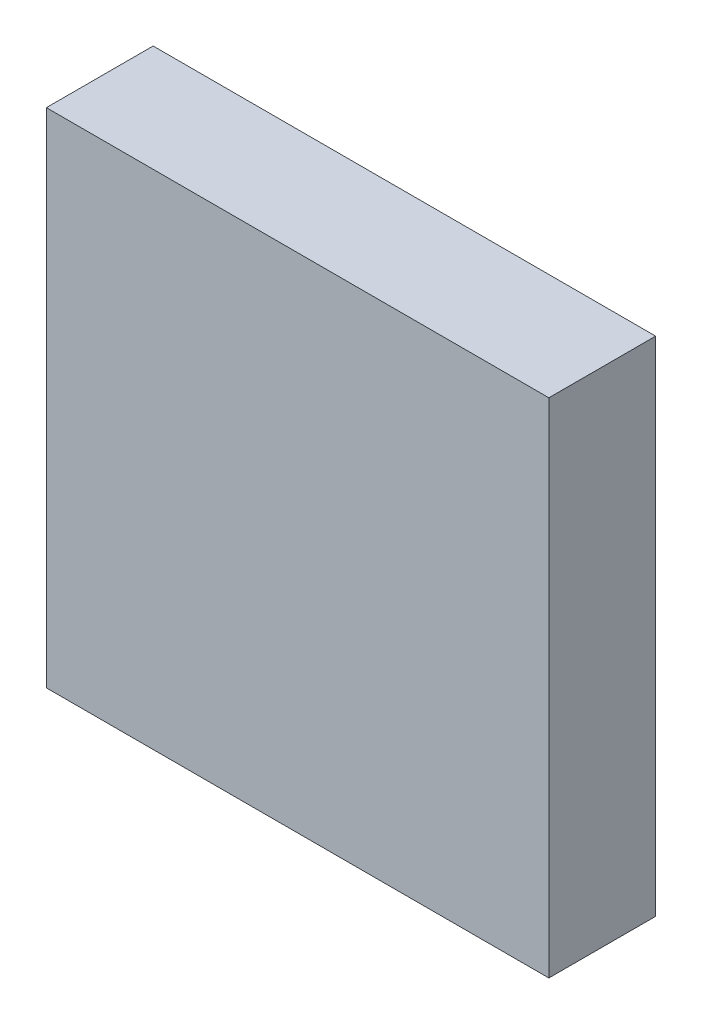
ISO-10303-21;
HEADER;
FILE_DESCRIPTION(('STEP AP214'),'2;1');
FILE_NAME('part.step','',(''),(''),'','','');
FILE_SCHEMA(('AUTOMOTIVE_DESIGN { 1 0 10303 214 1 1 1 1 }'));
ENDSEC;
DATA;
#1=APPLICATION_CONTEXT('core data for automotive mechanical design processes');
#2=APPLICATION_PROTOCOL_DEFINITION('international standard','automotive_design',2000,#1);
#3=PRODUCT_CONTEXT('',#1,'mechanical');
#4=PRODUCT('Part','Part','',(#3));
#5=PRODUCT_RELATED_PRODUCT_CATEGORY('part','',(#4));
#6=PRODUCT_DEFINITION_FORMATION('','',#4);
#7=PRODUCT_DEFINITION_CONTEXT('part definition',#1,'design');
#8=PRODUCT_DEFINITION('design','',#6,#7);
#9=PRODUCT_DEFINITION_SHAPE('','',#8);
#10=(LENGTH_UNIT() NAMED_UNIT(*) SI_UNIT(.MILLI.,.METRE.));
#11=(NAMED_UNIT(*) PLANE_ANGLE_UNIT() SI_UNIT($,.RADIAN.));
#12=(NAMED_UNIT(*) SI_UNIT($,.STERADIAN.) SOLID_ANGLE_UNIT());
#13=UNCERTAINTY_MEASURE_WITH_UNIT(LENGTH_MEASURE(1.E-05),#10,'distance_accuracy_value','');
#14=(GEOMETRIC_REPRESENTATION_CONTEXT(3) GLOBAL_UNCERTAINTY_ASSIGNED_CONTEXT((#13)) GLOBAL_UNIT_ASSIGNED_CONTEXT((#10,
#11,#12)) REPRESENTATION_CONTEXT('',''));
#15=CARTESIAN_POINT('',(0.,0.,0.));
#16=DIRECTION('',(0.,0.,1.));
#17=DIRECTION('',(1.,0.,0.));
#18=AXIS2_PLACEMENT_3D('',#15,#16,#17);
#19=CARTESIAN_POINT('',(2.00000108,-1.99999854,0.85000084));
#20=DIRECTION('',(0.,0.,-1.));
#21=DIRECTION('',(-1.,0.,0.));
#22=AXIS2_PLACEMENT_3D('',#19,#20,#21);
#23=PLANE('',#22);
#24=DIRECTION('',(1.,0.,0.));
#25=VECTOR('',#24,1.);
#26=CARTESIAN_POINT('',(2.00000108,2.00000108,0.85000084));
#27=LINE('',#26,#25);
#28=CARTESIAN_POINT('',(2.00000108,2.00000108,0.85000084));
#29=VERTEX_POINT('',#28);
#30=CARTESIAN_POINT('',(-1.99999854,2.00000108,0.85000084));
#31=VERTEX_POINT('',#30);
#32=EDGE_CURVE('E55',#29,#31,#27,.F.);
#33=ORIENTED_EDGE('',*,*,#32,.T.);
#34=DIRECTION('',(0.,1.,0.));
#35=VECTOR('',#34,1.);
#36=CARTESIAN_POINT('',(-1.99999854,2.00000108,0.85000084));
#37=LINE('',#36,#35);
#38=CARTESIAN_POINT('',(-1.99999854,-1.99999854,0.85000084));
#39=VERTEX_POINT('',#38);
#40=EDGE_CURVE('E57',#31,#39,#37,.F.);
#41=ORIENTED_EDGE('',*,*,#40,.T.);
#42=DIRECTION('',(1.,0.,0.));
#43=VECTOR('',#42,1.);
#44=CARTESIAN_POINT('',(-1.99999854,-1.99999854,0.85000084));
#45=LINE('',#44,#43);
#46=CARTESIAN_POINT('',(2.00000108,-1.99999854,0.85000084));
#47=VERTEX_POINT('',#46);
#48=EDGE_CURVE('E20',#39,#47,#45,.T.);
#49=ORIENTED_EDGE('',*,*,#48,.T.);
#50=DIRECTION('',(0.,1.,0.));
#51=VECTOR('',#50,1.);
#52=CARTESIAN_POINT('',(2.00000108,-1.99999854,0.85000084));
#53=LINE('',#52,#51);
#54=EDGE_CURVE('E80',#47,#29,#53,.T.);
#55=ORIENTED_EDGE('',*,*,#54,.T.);
#56=EDGE_LOOP('',(#33,#41,#49,#55));
#57=FACE_BOUND('',#56,.T.);
#58=ADVANCED_FACE('F17',(#57),#23,.F.);
#59=CARTESIAN_POINT('',(-1.99999854,-1.99999854,0.));
#60=DIRECTION('',(0.,1.,0.));
#61=DIRECTION('',(0.,0.,1.));
#62=AXIS2_PLACEMENT_3D('',#59,#60,#61);
#63=PLANE('',#62);
#64=DIRECTION('',(0.,0.,1.));
#65=VECTOR('',#64,1.);
#66=CARTESIAN_POINT('',(2.00000108,-1.99999854,0.));
#67=LINE('',#66,#65);
#68=CARTESIAN_POINT('',(2.00000108,-1.99999854,0.));
#69=VERTEX_POINT('',#68);
#70=EDGE_CURVE('E68',#69,#47,#67,.T.);
#71=ORIENTED_EDGE('',*,*,#70,.T.);
#72=ORIENTED_EDGE('',*,*,#48,.F.);
#73=DIRECTION('',(0.,0.,-1.));
#74=VECTOR('',#73,1.);
#75=CARTESIAN_POINT('',(-1.99999854,-1.99999854,0.));
#76=LINE('',#75,#74);
#77=CARTESIAN_POINT('',(-1.99999854,-1.99999854,0.));
#78=VERTEX_POINT('',#77);
#79=EDGE_CURVE('E63',#39,#78,#76,.T.);
#80=ORIENTED_EDGE('',*,*,#79,.T.);
#81=DIRECTION('',(-1.,0.,0.));
#82=VECTOR('',#81,1.);
#83=CARTESIAN_POINT('',(2.00000108,-1.99999854,0.));
#84=LINE('',#83,#82);
#85=EDGE_CURVE('E83',#69,#78,#84,.T.);
#86=ORIENTED_EDGE('',*,*,#85,.F.);
#87=EDGE_LOOP('',(#71,#72,#80,#86));
#88=FACE_BOUND('',#87,.T.);
#89=ADVANCED_FACE('F65',(#88),#63,.F.);
#90=CARTESIAN_POINT('',(-1.99999854,2.00000108,0.));
#91=DIRECTION('',(1.,0.,0.));
#92=DIRECTION('',(0.,0.,-1.));
#93=AXIS2_PLACEMENT_3D('',#90,#91,#92);
#94=PLANE('',#93);
#95=ORIENTED_EDGE('',*,*,#79,.F.);
#96=ORIENTED_EDGE('',*,*,#40,.F.);
#97=DIRECTION('',(0.,0.,-1.));
#98=VECTOR('',#97,1.);
#99=CARTESIAN_POINT('',(-1.99999854,2.00000108,0.));
#100=LINE('',#99,#98);
#101=CARTESIAN_POINT('',(-1.99999854,2.00000108,0.));
#102=VERTEX_POINT('',#101);
#103=EDGE_CURVE('E75',#31,#102,#100,.T.);
#104=ORIENTED_EDGE('',*,*,#103,.T.);
#105=DIRECTION('',(0.,1.,0.));
#106=VECTOR('',#105,1.);
#107=CARTESIAN_POINT('',(-1.99999854,-1.99999854,0.));
#108=LINE('',#107,#106);
#109=EDGE_CURVE('E72',#78,#102,#108,.T.);
#110=ORIENTED_EDGE('',*,*,#109,.F.);
#111=EDGE_LOOP('',(#95,#96,#104,#110));
#112=FACE_BOUND('',#111,.T.);
#113=ADVANCED_FACE('F70',(#112),#94,.F.);
#114=CARTESIAN_POINT('',(2.00000108,2.00000108,0.));
#115=DIRECTION('',(0.,-1.,0.));
#116=DIRECTION('',(0.,0.,-1.));
#117=AXIS2_PLACEMENT_3D('',#114,#115,#116);
#118=PLANE('',#117);
#119=ORIENTED_EDGE('',*,*,#103,.F.);
#120=ORIENTED_EDGE('',*,*,#32,.F.);
#121=DIRECTION('',(0.,0.,1.));
#122=VECTOR('',#121,1.);
#123=CARTESIAN_POINT('',(2.00000108,2.00000108,0.));
#124=LINE('',#123,#122);
#125=CARTESIAN_POINT('',(2.00000108,2.00000108,0.));
#126=VERTEX_POINT('',#125);
#127=EDGE_CURVE('E35',#29,#126,#124,.F.);
#128=ORIENTED_EDGE('',*,*,#127,.T.);
#129=DIRECTION('',(-1.,0.,0.));
#130=VECTOR('',#129,1.);
#131=CARTESIAN_POINT('',(2.00000108,2.00000108,0.));
#132=LINE('',#131,#130);
#133=EDGE_CURVE('E26',#102,#126,#132,.F.);
#134=ORIENTED_EDGE('',*,*,#133,.F.);
#135=EDGE_LOOP('',(#119,#120,#128,#134));
#136=FACE_BOUND('',#135,.T.);
#137=ADVANCED_FACE('F89',(#136),#118,.F.);
#138=CARTESIAN_POINT('',(2.00000108,-1.99999854,0.));
#139=DIRECTION('',(-1.,0.,0.));
#140=DIRECTION('',(0.,0.,1.));
#141=AXIS2_PLACEMENT_3D('',#138,#139,#140);
#142=PLANE('',#141);
#143=ORIENTED_EDGE('',*,*,#127,.F.);
#144=ORIENTED_EDGE('',*,*,#54,.F.);
#145=ORIENTED_EDGE('',*,*,#70,.F.);
#146=DIRECTION('',(0.,1.,0.));
#147=VECTOR('',#146,1.);
#148=CARTESIAN_POINT('',(2.00000108,-1.99999854,0.));
#149=LINE('',#148,#147);
#150=EDGE_CURVE('E11',#126,#69,#149,.F.);
#151=ORIENTED_EDGE('',*,*,#150,.F.);
#152=EDGE_LOOP('',(#143,#144,#145,#151));
#153=FACE_BOUND('',#152,.T.);
#154=ADVANCED_FACE('F91',(#153),#142,.F.);
#155=CARTESIAN_POINT('',(2.00000108,-1.99999854,0.));
#156=DIRECTION('',(0.,0.,-1.));
#157=DIRECTION('',(-1.,0.,0.));
#158=AXIS2_PLACEMENT_3D('',#155,#156,#157);
#159=PLANE('',#158);
#160=ORIENTED_EDGE('',*,*,#133,.T.);
#161=ORIENTED_EDGE('',*,*,#150,.T.);
#162=ORIENTED_EDGE('',*,*,#85,.T.);
#163=ORIENTED_EDGE('',*,*,#109,.T.);
#164=EDGE_LOOP('',(#160,#161,#162,#163));
#165=FACE_BOUND('',#164,.T.);
#166=ADVANCED_FACE('F88',(#165),#159,.T.);
#167=CLOSED_SHELL('',(#58,#89,#113,#137,#154,#166));
#168=MANIFOLD_SOLID_BREP('B1',#167);
#169=ADVANCED_BREP_SHAPE_REPRESENTATION('',(#18,#168),#14);
#170=SHAPE_DEFINITION_REPRESENTATION(#9,#169);
ENDSEC;
END-ISO-10303-21;
